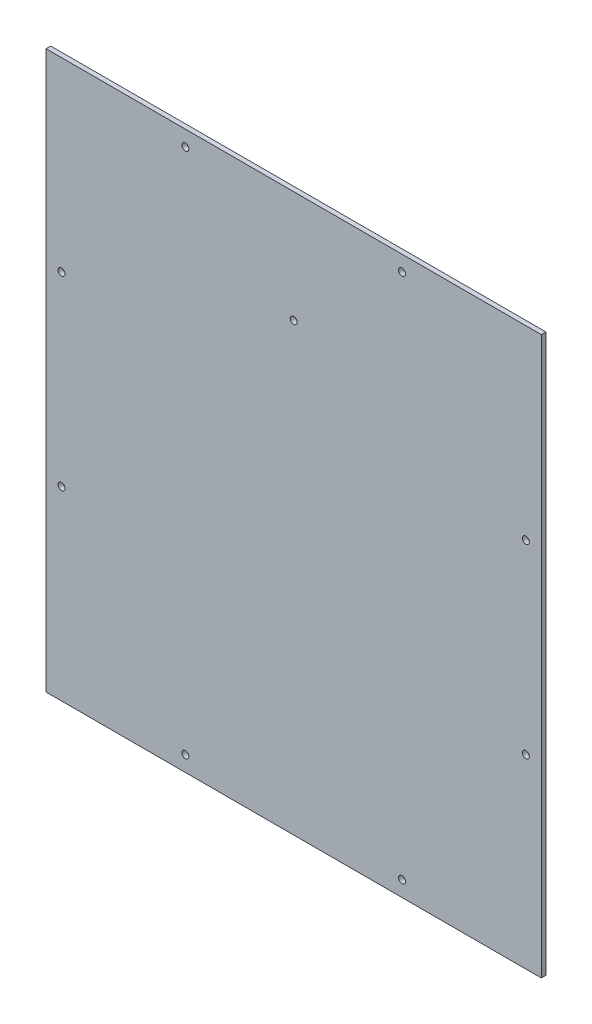
ISO-10303-21;
HEADER;
FILE_DESCRIPTION(('STEP AP214'),'2;1');
FILE_NAME('part.step','',(''),(''),'','','');
FILE_SCHEMA(('AUTOMOTIVE_DESIGN { 1 0 10303 214 1 1 1 1 }'));
ENDSEC;
DATA;
#1=APPLICATION_CONTEXT('core data for automotive mechanical design processes');
#2=APPLICATION_PROTOCOL_DEFINITION('international standard','automotive_design',2000,#1);
#3=PRODUCT_CONTEXT('',#1,'mechanical');
#4=PRODUCT('Part','Part','',(#3));
#5=PRODUCT_RELATED_PRODUCT_CATEGORY('part','',(#4));
#6=PRODUCT_DEFINITION_FORMATION('','',#4);
#7=PRODUCT_DEFINITION_CONTEXT('part definition',#1,'design');
#8=PRODUCT_DEFINITION('design','',#6,#7);
#9=PRODUCT_DEFINITION_SHAPE('','',#8);
#10=(LENGTH_UNIT() NAMED_UNIT(*) SI_UNIT(.MILLI.,.METRE.));
#11=(NAMED_UNIT(*) PLANE_ANGLE_UNIT() SI_UNIT($,.RADIAN.));
#12=(NAMED_UNIT(*) SI_UNIT($,.STERADIAN.) SOLID_ANGLE_UNIT());
#13=UNCERTAINTY_MEASURE_WITH_UNIT(LENGTH_MEASURE(1.E-05),#10,'distance_accuracy_value','');
#14=(GEOMETRIC_REPRESENTATION_CONTEXT(3) GLOBAL_UNCERTAINTY_ASSIGNED_CONTEXT((#13)) GLOBAL_UNIT_ASSIGNED_CONTEXT((#10,
#11,#12)) REPRESENTATION_CONTEXT('',''));
#15=CARTESIAN_POINT('',(0.,0.,0.));
#16=DIRECTION('',(0.,0.,1.));
#17=DIRECTION('',(1.,0.,0.));
#18=AXIS2_PLACEMENT_3D('',#15,#16,#17);
#19=CARTESIAN_POINT('',(0.,0.,3.));
#20=DIRECTION('',(0.,0.,-1.));
#21=DIRECTION('',(-1.,0.,0.));
#22=AXIS2_PLACEMENT_3D('',#19,#20,#21);
#23=PLANE('',#22);
#24=CARTESIAN_POINT('',(160.,288.,3.));
#25=DIRECTION('',(0.,0.,1.));
#26=DIRECTION('',(1.,0.,0.));
#27=AXIS2_PLACEMENT_3D('',#24,#25,#26);
#28=CIRCLE('',#27,2.25000000000001);
#29=CARTESIAN_POINT('',(162.25,288.,3.));
#30=VERTEX_POINT('',#29);
#31=EDGE_CURVE('E164',#30,#30,#28,.T.);
#32=ORIENTED_EDGE('',*,*,#31,.F.);
#33=EDGE_LOOP('',(#32));
#34=FACE_BOUND('',#33,.T.);
#35=DIRECTION('',(0.,-1.,0.));
#36=VECTOR('',#35,1.);
#37=CARTESIAN_POINT('',(0.,0.,3.));
#38=LINE('',#37,#36);
#39=CARTESIAN_POINT('',(0.,360.,3.));
#40=VERTEX_POINT('',#39);
#41=CARTESIAN_POINT('',(0.,0.,3.));
#42=VERTEX_POINT('',#41);
#43=EDGE_CURVE('E89',#40,#42,#38,.T.);
#44=ORIENTED_EDGE('',*,*,#43,.T.);
#45=DIRECTION('',(1.,0.,0.));
#46=VECTOR('',#45,1.);
#47=CARTESIAN_POINT('',(0.,0.,3.));
#48=LINE('',#47,#46);
#49=CARTESIAN_POINT('',(320.,0.,3.));
#50=VERTEX_POINT('',#49);
#51=EDGE_CURVE('E84',#42,#50,#48,.T.);
#52=ORIENTED_EDGE('',*,*,#51,.T.);
#53=DIRECTION('',(0.,1.,0.));
#54=VECTOR('',#53,1.);
#55=CARTESIAN_POINT('',(320.,0.,3.));
#56=LINE('',#55,#54);
#57=CARTESIAN_POINT('',(320.,360.,3.));
#58=VERTEX_POINT('',#57);
#59=EDGE_CURVE('E87',#50,#58,#56,.T.);
#60=ORIENTED_EDGE('',*,*,#59,.T.);
#61=DIRECTION('',(-1.,0.,0.));
#62=VECTOR('',#61,1.);
#63=CARTESIAN_POINT('',(0.,360.,3.));
#64=LINE('',#63,#62);
#65=EDGE_CURVE('E54',#58,#40,#64,.T.);
#66=ORIENTED_EDGE('',*,*,#65,.T.);
#67=EDGE_LOOP('',(#44,#52,#60,#66));
#68=FACE_BOUND('',#67,.T.);
#69=CARTESIAN_POINT('',(90.,350.,3.));
#70=DIRECTION('',(0.,0.,1.));
#71=DIRECTION('',(1.,0.,0.));
#72=AXIS2_PLACEMENT_3D('',#69,#70,#71);
#73=CIRCLE('',#72,2.25);
#74=CARTESIAN_POINT('',(92.25,350.,3.));
#75=VERTEX_POINT('',#74);
#76=EDGE_CURVE('E104',#75,#75,#73,.T.);
#77=ORIENTED_EDGE('',*,*,#76,.F.);
#78=EDGE_LOOP('',(#77));
#79=FACE_BOUND('',#78,.T.);
#80=CARTESIAN_POINT('',(230.,350.,3.));
#81=DIRECTION('',(0.,0.,1.));
#82=DIRECTION('',(1.,0.,0.));
#83=AXIS2_PLACEMENT_3D('',#80,#81,#82);
#84=CIRCLE('',#83,2.25000000000001);
#85=CARTESIAN_POINT('',(232.25,350.,3.));
#86=VERTEX_POINT('',#85);
#87=EDGE_CURVE('E119',#86,#86,#84,.T.);
#88=ORIENTED_EDGE('',*,*,#87,.F.);
#89=EDGE_LOOP('',(#88));
#90=FACE_BOUND('',#89,.T.);
#91=CARTESIAN_POINT('',(9.99999999999996,240.,3.));
#92=DIRECTION('',(0.,0.,1.));
#93=DIRECTION('',(1.,0.,0.));
#94=AXIS2_PLACEMENT_3D('',#91,#92,#93);
#95=CIRCLE('',#94,2.25);
#96=CARTESIAN_POINT('',(12.25,240.,3.));
#97=VERTEX_POINT('',#96);
#98=EDGE_CURVE('E125',#97,#97,#95,.T.);
#99=ORIENTED_EDGE('',*,*,#98,.F.);
#100=EDGE_LOOP('',(#99));
#101=FACE_BOUND('',#100,.T.);
#102=CARTESIAN_POINT('',(9.99999999999996,120.,3.));
#103=DIRECTION('',(0.,0.,1.));
#104=DIRECTION('',(1.,0.,0.));
#105=AXIS2_PLACEMENT_3D('',#102,#103,#104);
#106=CIRCLE('',#105,2.25);
#107=CARTESIAN_POINT('',(12.25,120.,3.));
#108=VERTEX_POINT('',#107);
#109=EDGE_CURVE('E131',#108,#108,#106,.T.);
#110=ORIENTED_EDGE('',*,*,#109,.F.);
#111=EDGE_LOOP('',(#110));
#112=FACE_BOUND('',#111,.T.);
#113=CARTESIAN_POINT('',(310.,240.,3.));
#114=DIRECTION('',(0.,0.,1.));
#115=DIRECTION('',(1.,0.,0.));
#116=AXIS2_PLACEMENT_3D('',#113,#114,#115);
#117=CIRCLE('',#116,2.24999999999996);
#118=CARTESIAN_POINT('',(312.25,240.,3.));
#119=VERTEX_POINT('',#118);
#120=EDGE_CURVE('E137',#119,#119,#117,.T.);
#121=ORIENTED_EDGE('',*,*,#120,.F.);
#122=EDGE_LOOP('',(#121));
#123=FACE_BOUND('',#122,.T.);
#124=CARTESIAN_POINT('',(310.,120.,3.));
#125=DIRECTION('',(0.,0.,1.));
#126=DIRECTION('',(1.,0.,0.));
#127=AXIS2_PLACEMENT_3D('',#124,#125,#126);
#128=CIRCLE('',#127,2.24999999999995);
#129=CARTESIAN_POINT('',(312.25,120.,3.));
#130=VERTEX_POINT('',#129);
#131=EDGE_CURVE('E143',#130,#130,#128,.T.);
#132=ORIENTED_EDGE('',*,*,#131,.F.);
#133=EDGE_LOOP('',(#132));
#134=FACE_BOUND('',#133,.T.);
#135=CARTESIAN_POINT('',(90.,10.,3.));
#136=DIRECTION('',(0.,0.,1.));
#137=DIRECTION('',(1.,0.,0.));
#138=AXIS2_PLACEMENT_3D('',#135,#136,#137);
#139=CIRCLE('',#138,2.25);
#140=CARTESIAN_POINT('',(92.25,10.,3.));
#141=VERTEX_POINT('',#140);
#142=EDGE_CURVE('E149',#141,#141,#139,.T.);
#143=ORIENTED_EDGE('',*,*,#142,.F.);
#144=EDGE_LOOP('',(#143));
#145=FACE_BOUND('',#144,.T.);
#146=CARTESIAN_POINT('',(230.,10.,3.));
#147=DIRECTION('',(0.,0.,1.));
#148=DIRECTION('',(1.,0.,0.));
#149=AXIS2_PLACEMENT_3D('',#146,#147,#148);
#150=CIRCLE('',#149,2.25000000000001);
#151=CARTESIAN_POINT('',(232.25,10.,3.));
#152=VERTEX_POINT('',#151);
#153=EDGE_CURVE('E155',#152,#152,#150,.T.);
#154=ORIENTED_EDGE('',*,*,#153,.F.);
#155=EDGE_LOOP('',(#154));
#156=FACE_BOUND('',#155,.T.);
#157=ADVANCED_FACE('F37',(#34,#68,#79,#90,#101,#112,#123,#134,#145,#156),#23,.F.);
#158=CARTESIAN_POINT('',(0.,0.,0.));
#159=DIRECTION('',(0.,0.,-1.));
#160=DIRECTION('',(-1.,0.,0.));
#161=AXIS2_PLACEMENT_3D('',#158,#159,#160);
#162=PLANE('',#161);
#163=CARTESIAN_POINT('',(160.,288.,0.));
#164=DIRECTION('',(0.,0.,1.));
#165=DIRECTION('',(1.,0.,0.));
#166=AXIS2_PLACEMENT_3D('',#163,#164,#165);
#167=CIRCLE('',#166,2.25000000000001);
#168=CARTESIAN_POINT('',(162.25,288.,0.));
#169=VERTEX_POINT('',#168);
#170=EDGE_CURVE('E161',#169,#169,#167,.T.);
#171=ORIENTED_EDGE('',*,*,#170,.T.);
#172=EDGE_LOOP('',(#171));
#173=FACE_BOUND('',#172,.T.);
#174=CARTESIAN_POINT('',(90.,10.,0.));
#175=DIRECTION('',(0.,0.,1.));
#176=DIRECTION('',(1.,0.,0.));
#177=AXIS2_PLACEMENT_3D('',#174,#175,#176);
#178=CIRCLE('',#177,2.25);
#179=CARTESIAN_POINT('',(92.25,10.,0.));
#180=VERTEX_POINT('',#179);
#181=EDGE_CURVE('E152',#180,#180,#178,.T.);
#182=ORIENTED_EDGE('',*,*,#181,.T.);
#183=EDGE_LOOP('',(#182));
#184=FACE_BOUND('',#183,.T.);
#185=CARTESIAN_POINT('',(310.,240.,0.));
#186=DIRECTION('',(0.,0.,1.));
#187=DIRECTION('',(1.,0.,0.));
#188=AXIS2_PLACEMENT_3D('',#185,#186,#187);
#189=CIRCLE('',#188,2.24999999999996);
#190=CARTESIAN_POINT('',(312.25,240.,0.));
#191=VERTEX_POINT('',#190);
#192=EDGE_CURVE('E140',#191,#191,#189,.T.);
#193=ORIENTED_EDGE('',*,*,#192,.T.);
#194=EDGE_LOOP('',(#193));
#195=FACE_BOUND('',#194,.T.);
#196=CARTESIAN_POINT('',(9.99999999999996,240.,0.));
#197=DIRECTION('',(0.,0.,1.));
#198=DIRECTION('',(1.,0.,0.));
#199=AXIS2_PLACEMENT_3D('',#196,#197,#198);
#200=CIRCLE('',#199,2.25);
#201=CARTESIAN_POINT('',(12.25,240.,0.));
#202=VERTEX_POINT('',#201);
#203=EDGE_CURVE('E128',#202,#202,#200,.T.);
#204=ORIENTED_EDGE('',*,*,#203,.T.);
#205=EDGE_LOOP('',(#204));
#206=FACE_BOUND('',#205,.T.);
#207=CARTESIAN_POINT('',(90.,350.,0.));
#208=DIRECTION('',(0.,0.,1.));
#209=DIRECTION('',(1.,0.,0.));
#210=AXIS2_PLACEMENT_3D('',#207,#208,#209);
#211=CIRCLE('',#210,2.25);
#212=CARTESIAN_POINT('',(92.25,350.,0.));
#213=VERTEX_POINT('',#212);
#214=EDGE_CURVE('E116',#213,#213,#211,.T.);
#215=ORIENTED_EDGE('',*,*,#214,.T.);
#216=EDGE_LOOP('',(#215));
#217=FACE_BOUND('',#216,.T.);
#218=DIRECTION('',(0.,-1.,0.));
#219=VECTOR('',#218,1.);
#220=CARTESIAN_POINT('',(0.,0.,0.));
#221=LINE('',#220,#219);
#222=CARTESIAN_POINT('',(0.,360.,0.));
#223=VERTEX_POINT('',#222);
#224=CARTESIAN_POINT('',(0.,0.,0.));
#225=VERTEX_POINT('',#224);
#226=EDGE_CURVE('E101',#223,#225,#221,.T.);
#227=ORIENTED_EDGE('',*,*,#226,.F.);
#228=DIRECTION('',(-1.,0.,0.));
#229=VECTOR('',#228,1.);
#230=CARTESIAN_POINT('',(0.,360.,0.));
#231=LINE('',#230,#229);
#232=CARTESIAN_POINT('',(320.,360.,0.));
#233=VERTEX_POINT('',#232);
#234=EDGE_CURVE('E77',#233,#223,#231,.T.);
#235=ORIENTED_EDGE('',*,*,#234,.F.);
#236=DIRECTION('',(0.,1.,0.));
#237=VECTOR('',#236,1.);
#238=CARTESIAN_POINT('',(320.,0.,0.));
#239=LINE('',#238,#237);
#240=CARTESIAN_POINT('',(320.,0.,0.));
#241=VERTEX_POINT('',#240);
#242=EDGE_CURVE('E71',#241,#233,#239,.T.);
#243=ORIENTED_EDGE('',*,*,#242,.F.);
#244=DIRECTION('',(1.,0.,0.));
#245=VECTOR('',#244,1.);
#246=CARTESIAN_POINT('',(0.,0.,0.));
#247=LINE('',#246,#245);
#248=EDGE_CURVE('E93',#225,#241,#247,.T.);
#249=ORIENTED_EDGE('',*,*,#248,.F.);
#250=EDGE_LOOP('',(#227,#235,#243,#249));
#251=FACE_BOUND('',#250,.T.);
#252=CARTESIAN_POINT('',(230.,350.,0.));
#253=DIRECTION('',(0.,0.,1.));
#254=DIRECTION('',(1.,0.,0.));
#255=AXIS2_PLACEMENT_3D('',#252,#253,#254);
#256=CIRCLE('',#255,2.25000000000001);
#257=CARTESIAN_POINT('',(232.25,350.,0.));
#258=VERTEX_POINT('',#257);
#259=EDGE_CURVE('E122',#258,#258,#256,.T.);
#260=ORIENTED_EDGE('',*,*,#259,.T.);
#261=EDGE_LOOP('',(#260));
#262=FACE_BOUND('',#261,.T.);
#263=CARTESIAN_POINT('',(9.99999999999996,120.,0.));
#264=DIRECTION('',(0.,0.,1.));
#265=DIRECTION('',(1.,0.,0.));
#266=AXIS2_PLACEMENT_3D('',#263,#264,#265);
#267=CIRCLE('',#266,2.25);
#268=CARTESIAN_POINT('',(12.25,120.,0.));
#269=VERTEX_POINT('',#268);
#270=EDGE_CURVE('E134',#269,#269,#267,.T.);
#271=ORIENTED_EDGE('',*,*,#270,.T.);
#272=EDGE_LOOP('',(#271));
#273=FACE_BOUND('',#272,.T.);
#274=CARTESIAN_POINT('',(310.,120.,0.));
#275=DIRECTION('',(0.,0.,1.));
#276=DIRECTION('',(1.,0.,0.));
#277=AXIS2_PLACEMENT_3D('',#274,#275,#276);
#278=CIRCLE('',#277,2.24999999999995);
#279=CARTESIAN_POINT('',(312.25,120.,0.));
#280=VERTEX_POINT('',#279);
#281=EDGE_CURVE('E146',#280,#280,#278,.T.);
#282=ORIENTED_EDGE('',*,*,#281,.T.);
#283=EDGE_LOOP('',(#282));
#284=FACE_BOUND('',#283,.T.);
#285=CARTESIAN_POINT('',(230.,10.,0.));
#286=DIRECTION('',(0.,0.,1.));
#287=DIRECTION('',(1.,0.,0.));
#288=AXIS2_PLACEMENT_3D('',#285,#286,#287);
#289=CIRCLE('',#288,2.25000000000001);
#290=CARTESIAN_POINT('',(232.25,10.,0.));
#291=VERTEX_POINT('',#290);
#292=EDGE_CURVE('E158',#291,#291,#289,.T.);
#293=ORIENTED_EDGE('',*,*,#292,.T.);
#294=EDGE_LOOP('',(#293));
#295=FACE_BOUND('',#294,.T.);
#296=ADVANCED_FACE('F112',(#173,#184,#195,#206,#217,#251,#262,#273,#284,#295),#162,.T.);
#297=CARTESIAN_POINT('',(0.,0.,3.));
#298=DIRECTION('',(1.,0.,0.));
#299=DIRECTION('',(0.,0.,-1.));
#300=AXIS2_PLACEMENT_3D('',#297,#298,#299);
#301=PLANE('',#300);
#302=ORIENTED_EDGE('',*,*,#226,.T.);
#303=DIRECTION('',(0.,0.,-1.));
#304=VECTOR('',#303,1.);
#305=CARTESIAN_POINT('',(0.,0.,3.));
#306=LINE('',#305,#304);
#307=EDGE_CURVE('E11',#42,#225,#306,.T.);
#308=ORIENTED_EDGE('',*,*,#307,.F.);
#309=ORIENTED_EDGE('',*,*,#43,.F.);
#310=DIRECTION('',(0.,0.,-1.));
#311=VECTOR('',#310,1.);
#312=CARTESIAN_POINT('',(0.,360.,3.));
#313=LINE('',#312,#311);
#314=EDGE_CURVE('E97',#40,#223,#313,.T.);
#315=ORIENTED_EDGE('',*,*,#314,.T.);
#316=EDGE_LOOP('',(#302,#308,#309,#315));
#317=FACE_BOUND('',#316,.T.);
#318=ADVANCED_FACE('F39',(#317),#301,.F.);
#319=CARTESIAN_POINT('',(0.,0.,3.));
#320=DIRECTION('',(0.,1.,0.));
#321=DIRECTION('',(0.,0.,1.));
#322=AXIS2_PLACEMENT_3D('',#319,#320,#321);
#323=PLANE('',#322);
#324=ORIENTED_EDGE('',*,*,#248,.T.);
#325=DIRECTION('',(0.,0.,-1.));
#326=VECTOR('',#325,1.);
#327=CARTESIAN_POINT('',(320.,0.,3.));
#328=LINE('',#327,#326);
#329=EDGE_CURVE('E46',#50,#241,#328,.T.);
#330=ORIENTED_EDGE('',*,*,#329,.F.);
#331=ORIENTED_EDGE('',*,*,#51,.F.);
#332=ORIENTED_EDGE('',*,*,#307,.T.);
#333=EDGE_LOOP('',(#324,#330,#331,#332));
#334=FACE_BOUND('',#333,.T.);
#335=ADVANCED_FACE('F92',(#334),#323,.F.);
#336=CARTESIAN_POINT('',(320.,0.,3.));
#337=DIRECTION('',(-1.,0.,0.));
#338=DIRECTION('',(0.,-1.,0.));
#339=AXIS2_PLACEMENT_3D('',#336,#337,#338);
#340=PLANE('',#339);
#341=ORIENTED_EDGE('',*,*,#242,.T.);
#342=DIRECTION('',(0.,0.,-1.));
#343=VECTOR('',#342,1.);
#344=CARTESIAN_POINT('',(320.,360.,3.));
#345=LINE('',#344,#343);
#346=EDGE_CURVE('E94',#58,#233,#345,.T.);
#347=ORIENTED_EDGE('',*,*,#346,.F.);
#348=ORIENTED_EDGE('',*,*,#59,.F.);
#349=ORIENTED_EDGE('',*,*,#329,.T.);
#350=EDGE_LOOP('',(#341,#347,#348,#349));
#351=FACE_BOUND('',#350,.T.);
#352=ADVANCED_FACE('F95',(#351),#340,.F.);
#353=CARTESIAN_POINT('',(0.,360.,3.));
#354=DIRECTION('',(0.,-1.,0.));
#355=DIRECTION('',(0.,0.,-1.));
#356=AXIS2_PLACEMENT_3D('',#353,#354,#355);
#357=PLANE('',#356);
#358=ORIENTED_EDGE('',*,*,#234,.T.);
#359=ORIENTED_EDGE('',*,*,#314,.F.);
#360=ORIENTED_EDGE('',*,*,#65,.F.);
#361=ORIENTED_EDGE('',*,*,#346,.T.);
#362=EDGE_LOOP('',(#358,#359,#360,#361));
#363=FACE_BOUND('',#362,.T.);
#364=ADVANCED_FACE('F109',(#363),#357,.F.);
#365=CARTESIAN_POINT('',(90.,350.,3.));
#366=DIRECTION('',(0.,0.,-1.));
#367=DIRECTION('',(-1.,0.,0.));
#368=AXIS2_PLACEMENT_3D('',#365,#366,#367);
#369=CYLINDRICAL_SURFACE('',#368,2.25);
#370=ORIENTED_EDGE('',*,*,#76,.T.);
#371=EDGE_LOOP('',(#370));
#372=FACE_BOUND('',#371,.T.);
#373=ORIENTED_EDGE('',*,*,#214,.F.);
#374=EDGE_LOOP('',(#373));
#375=FACE_BOUND('',#374,.T.);
#376=ADVANCED_FACE('F186',(#372,#375),#369,.F.);
#377=CARTESIAN_POINT('',(230.,350.,3.));
#378=DIRECTION('',(0.,0.,-1.));
#379=DIRECTION('',(-1.,0.,0.));
#380=AXIS2_PLACEMENT_3D('',#377,#378,#379);
#381=CYLINDRICAL_SURFACE('',#380,2.25000000000001);
#382=ORIENTED_EDGE('',*,*,#87,.T.);
#383=EDGE_LOOP('',(#382));
#384=FACE_BOUND('',#383,.T.);
#385=ORIENTED_EDGE('',*,*,#259,.F.);
#386=EDGE_LOOP('',(#385));
#387=FACE_BOUND('',#386,.T.);
#388=ADVANCED_FACE('F258',(#384,#387),#381,.F.);
#389=CARTESIAN_POINT('',(9.99999999999996,240.,3.));
#390=DIRECTION('',(0.,0.,-1.));
#391=DIRECTION('',(-1.,0.,0.));
#392=AXIS2_PLACEMENT_3D('',#389,#390,#391);
#393=CYLINDRICAL_SURFACE('',#392,2.25);
#394=ORIENTED_EDGE('',*,*,#98,.T.);
#395=EDGE_LOOP('',(#394));
#396=FACE_BOUND('',#395,.T.);
#397=ORIENTED_EDGE('',*,*,#203,.F.);
#398=EDGE_LOOP('',(#397));
#399=FACE_BOUND('',#398,.T.);
#400=ADVANCED_FACE('F250',(#396,#399),#393,.F.);
#401=CARTESIAN_POINT('',(9.99999999999996,120.,3.));
#402=DIRECTION('',(0.,0.,-1.));
#403=DIRECTION('',(-1.,0.,0.));
#404=AXIS2_PLACEMENT_3D('',#401,#402,#403);
#405=CYLINDRICAL_SURFACE('',#404,2.25);
#406=ORIENTED_EDGE('',*,*,#109,.T.);
#407=EDGE_LOOP('',(#406));
#408=FACE_BOUND('',#407,.T.);
#409=ORIENTED_EDGE('',*,*,#270,.F.);
#410=EDGE_LOOP('',(#409));
#411=FACE_BOUND('',#410,.T.);
#412=ADVANCED_FACE('F242',(#408,#411),#405,.F.);
#413=CARTESIAN_POINT('',(310.,240.,3.));
#414=DIRECTION('',(0.,0.,-1.));
#415=DIRECTION('',(-1.,0.,0.));
#416=AXIS2_PLACEMENT_3D('',#413,#414,#415);
#417=CYLINDRICAL_SURFACE('',#416,2.24999999999996);
#418=ORIENTED_EDGE('',*,*,#120,.T.);
#419=EDGE_LOOP('',(#418));
#420=FACE_BOUND('',#419,.T.);
#421=ORIENTED_EDGE('',*,*,#192,.F.);
#422=EDGE_LOOP('',(#421));
#423=FACE_BOUND('',#422,.T.);
#424=ADVANCED_FACE('F234',(#420,#423),#417,.F.);
#425=CARTESIAN_POINT('',(310.,120.,3.));
#426=DIRECTION('',(0.,0.,-1.));
#427=DIRECTION('',(-1.,0.,0.));
#428=AXIS2_PLACEMENT_3D('',#425,#426,#427);
#429=CYLINDRICAL_SURFACE('',#428,2.24999999999995);
#430=ORIENTED_EDGE('',*,*,#131,.T.);
#431=EDGE_LOOP('',(#430));
#432=FACE_BOUND('',#431,.T.);
#433=ORIENTED_EDGE('',*,*,#281,.F.);
#434=EDGE_LOOP('',(#433));
#435=FACE_BOUND('',#434,.T.);
#436=ADVANCED_FACE('F226',(#432,#435),#429,.F.);
#437=CARTESIAN_POINT('',(90.,10.,3.));
#438=DIRECTION('',(0.,0.,-1.));
#439=DIRECTION('',(-1.,0.,0.));
#440=AXIS2_PLACEMENT_3D('',#437,#438,#439);
#441=CYLINDRICAL_SURFACE('',#440,2.25);
#442=ORIENTED_EDGE('',*,*,#142,.T.);
#443=EDGE_LOOP('',(#442));
#444=FACE_BOUND('',#443,.T.);
#445=ORIENTED_EDGE('',*,*,#181,.F.);
#446=EDGE_LOOP('',(#445));
#447=FACE_BOUND('',#446,.T.);
#448=ADVANCED_FACE('F219',(#444,#447),#441,.F.);
#449=CARTESIAN_POINT('',(230.,10.,3.));
#450=DIRECTION('',(0.,0.,-1.));
#451=DIRECTION('',(-1.,0.,0.));
#452=AXIS2_PLACEMENT_3D('',#449,#450,#451);
#453=CYLINDRICAL_SURFACE('',#452,2.25000000000001);
#454=ORIENTED_EDGE('',*,*,#153,.T.);
#455=EDGE_LOOP('',(#454));
#456=FACE_BOUND('',#455,.T.);
#457=ORIENTED_EDGE('',*,*,#292,.F.);
#458=EDGE_LOOP('',(#457));
#459=FACE_BOUND('',#458,.T.);
#460=ADVANCED_FACE('F175',(#456,#459),#453,.F.);
#461=CARTESIAN_POINT('',(160.,288.,0.));
#462=DIRECTION('',(0.,0.,1.));
#463=DIRECTION('',(1.,0.,0.));
#464=AXIS2_PLACEMENT_3D('',#461,#462,#463);
#465=CYLINDRICAL_SURFACE('',#464,2.25000000000001);
#466=ORIENTED_EDGE('',*,*,#170,.F.);
#467=EDGE_LOOP('',(#466));
#468=FACE_BOUND('',#467,.T.);
#469=ORIENTED_EDGE('',*,*,#31,.T.);
#470=EDGE_LOOP('',(#469));
#471=FACE_BOUND('',#470,.T.);
#472=ADVANCED_FACE('F172',(#468,#471),#465,.F.);
#473=CLOSED_SHELL('',(#157,#296,#318,#335,#352,#364,#376,#388,#400,#412,#424,#436,#448,#460,#472));
#474=MANIFOLD_SOLID_BREP('B2',#473);
#475=ADVANCED_BREP_SHAPE_REPRESENTATION('',(#18,#474),#14);
#476=SHAPE_DEFINITION_REPRESENTATION(#9,#475);
ENDSEC;
END-ISO-10303-21;
